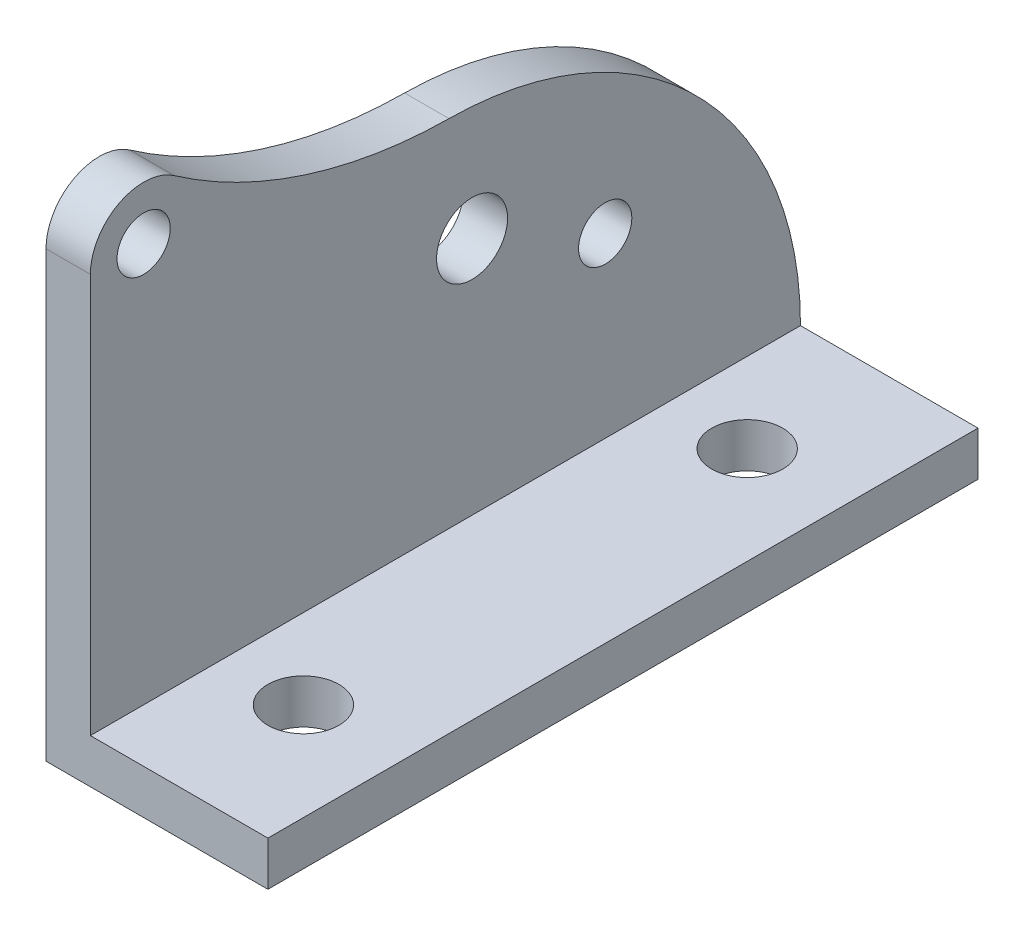
ISO-10303-21;
HEADER;
FILE_DESCRIPTION(('STEP AP214'),'2;1');
FILE_NAME('part.step','',(''),(''),'','','');
FILE_SCHEMA(('AUTOMOTIVE_DESIGN { 1 0 10303 214 1 1 1 1 }'));
ENDSEC;
DATA;
#1=APPLICATION_CONTEXT('core data for automotive mechanical design processes');
#2=APPLICATION_PROTOCOL_DEFINITION('international standard','automotive_design',2000,#1);
#3=PRODUCT_CONTEXT('',#1,'mechanical');
#4=PRODUCT('Part','Part','',(#3));
#5=PRODUCT_RELATED_PRODUCT_CATEGORY('part','',(#4));
#6=PRODUCT_DEFINITION_FORMATION('','',#4);
#7=PRODUCT_DEFINITION_CONTEXT('part definition',#1,'design');
#8=PRODUCT_DEFINITION('design','',#6,#7);
#9=PRODUCT_DEFINITION_SHAPE('','',#8);
#10=(LENGTH_UNIT() NAMED_UNIT(*) SI_UNIT(.MILLI.,.METRE.));
#11=(NAMED_UNIT(*) PLANE_ANGLE_UNIT() SI_UNIT($,.RADIAN.));
#12=(NAMED_UNIT(*) SI_UNIT($,.STERADIAN.) SOLID_ANGLE_UNIT());
#13=UNCERTAINTY_MEASURE_WITH_UNIT(LENGTH_MEASURE(1.E-05),#10,'distance_accuracy_value','');
#14=(GEOMETRIC_REPRESENTATION_CONTEXT(3) GLOBAL_UNCERTAINTY_ASSIGNED_CONTEXT((#13)) GLOBAL_UNIT_ASSIGNED_CONTEXT((#10,
#11,#12)) REPRESENTATION_CONTEXT('',''));
#15=CARTESIAN_POINT('',(0.,0.,0.));
#16=DIRECTION('',(0.,0.,1.));
#17=DIRECTION('',(1.,0.,0.));
#18=AXIS2_PLACEMENT_3D('',#15,#16,#17);
#19=CARTESIAN_POINT('',(5.,0.,0.));
#20=DIRECTION('',(1.,0.,0.));
#21=DIRECTION('',(0.,0.,-1.));
#22=AXIS2_PLACEMENT_3D('',#19,#20,#21);
#23=PLANE('',#22);
#24=CARTESIAN_POINT('',(5.,-25.,-18.));
#25=DIRECTION('',(1.,0.,0.));
#26=DIRECTION('',(0.,0.,-1.));
#27=AXIS2_PLACEMENT_3D('',#24,#25,#26);
#28=CIRCLE('',#27,3.);
#29=CARTESIAN_POINT('',(5.,-25.,-21.));
#30=VERTEX_POINT('',#29);
#31=EDGE_CURVE('E282',#30,#30,#28,.T.);
#32=ORIENTED_EDGE('',*,*,#31,.F.);
#33=EDGE_LOOP('',(#32));
#34=FACE_BOUND('',#33,.T.);
#35=CARTESIAN_POINT('',(5.,-18.,-2.99999999999999));
#36=DIRECTION('',(1.,0.,0.));
#37=DIRECTION('',(0.,0.,-1.));
#38=AXIS2_PLACEMENT_3D('',#35,#36,#37);
#39=CIRCLE('',#38,4.);
#40=CARTESIAN_POINT('',(5.,-18.,-6.99999999999999));
#41=VERTEX_POINT('',#40);
#42=EDGE_CURVE('E151',#41,#41,#39,.T.);
#43=ORIENTED_EDGE('',*,*,#42,.F.);
#44=EDGE_LOOP('',(#43));
#45=FACE_BOUND('',#44,.T.);
#46=CARTESIAN_POINT('',(5.,0.,34.));
#47=DIRECTION('',(1.,0.,0.));
#48=DIRECTION('',(0.,0.,-1.));
#49=AXIS2_PLACEMENT_3D('',#46,#47,#48);
#50=CIRCLE('',#49,5.99999999999999);
#51=CARTESIAN_POINT('',(5.,0.,40.));
#52=VERTEX_POINT('',#51);
#53=CARTESIAN_POINT('',(5.,4.91756595476615,30.5623343559146));
#54=VERTEX_POINT('',#53);
#55=EDGE_CURVE('E137',#52,#54,#50,.F.);
#56=ORIENTED_EDGE('',*,*,#55,.F.);
#57=DIRECTION('',(0.,-1.,0.));
#58=VECTOR('',#57,1.);
#59=CARTESIAN_POINT('',(5.,50.,40.));
#60=LINE('',#59,#58);
#61=CARTESIAN_POINT('',(5.,-45.,40.));
#62=VERTEX_POINT('',#61);
#63=EDGE_CURVE('E201',#52,#62,#60,.T.);
#64=ORIENTED_EDGE('',*,*,#63,.T.);
#65=DIRECTION('',(0.,0.,1.));
#66=VECTOR('',#65,1.);
#67=CARTESIAN_POINT('',(5.,-45.,40.));
#68=LINE('',#67,#66);
#69=CARTESIAN_POINT('',(5.,-45.,-40.));
#70=VERTEX_POINT('',#69);
#71=EDGE_CURVE('E169',#70,#62,#68,.T.);
#72=ORIENTED_EDGE('',*,*,#71,.F.);
#73=CARTESIAN_POINT('',(5.,-45.,0.));
#74=DIRECTION('',(1.,0.,0.));
#75=DIRECTION('',(0.,0.,-1.));
#76=AXIS2_PLACEMENT_3D('',#73,#74,#75);
#77=CIRCLE('',#76,40.);
#78=CARTESIAN_POINT('',(5.,-5.00199836907123,-0.399831879944413));
#79=VERTEX_POINT('',#78);
#80=EDGE_CURVE('E140',#79,#70,#77,.F.);
#81=ORIENTED_EDGE('',*,*,#80,.F.);
#82=CARTESIAN_POINT('',(5.,49.9952538734558,-0.949600714868));
#83=DIRECTION('',(1.,0.,0.));
#84=DIRECTION('',(0.,0.,-1.));
#85=AXIS2_PLACEMENT_3D('',#82,#83,#84);
#86=CIRCLE('',#85,55.);
#87=EDGE_CURVE('E123',#79,#54,#86,.F.);
#88=ORIENTED_EDGE('',*,*,#87,.T.);
#89=EDGE_LOOP('',(#56,#64,#72,#81,#88));
#90=FACE_BOUND('',#89,.T.);
#91=CARTESIAN_POINT('',(5.,0.,34.));
#92=DIRECTION('',(1.,0.,0.));
#93=DIRECTION('',(0.,0.,-1.));
#94=AXIS2_PLACEMENT_3D('',#91,#92,#93);
#95=CIRCLE('',#94,3.);
#96=CARTESIAN_POINT('',(5.,0.,31.));
#97=VERTEX_POINT('',#96);
#98=EDGE_CURVE('E143',#97,#97,#95,.F.);
#99=ORIENTED_EDGE('',*,*,#98,.T.);
#100=EDGE_LOOP('',(#99));
#101=FACE_BOUND('',#100,.T.);
#102=ADVANCED_FACE('F53',(#34,#45,#90,#101),#23,.T.);
#103=CARTESIAN_POINT('',(0.,0.,0.));
#104=DIRECTION('',(1.,0.,0.));
#105=DIRECTION('',(0.,0.,-1.));
#106=AXIS2_PLACEMENT_3D('',#103,#104,#105);
#107=PLANE('',#106);
#108=CARTESIAN_POINT('',(0.,-25.,-18.));
#109=DIRECTION('',(-1.,0.,0.));
#110=DIRECTION('',(0.,0.,1.));
#111=AXIS2_PLACEMENT_3D('',#108,#109,#110);
#112=CIRCLE('',#111,3.);
#113=CARTESIAN_POINT('',(0.,-25.,-15.));
#114=VERTEX_POINT('',#113);
#115=EDGE_CURVE('E285',#114,#114,#112,.T.);
#116=ORIENTED_EDGE('',*,*,#115,.F.);
#117=EDGE_LOOP('',(#116));
#118=FACE_BOUND('',#117,.T.);
#119=DIRECTION('',(0.,-1.,0.));
#120=VECTOR('',#119,1.);
#121=CARTESIAN_POINT('',(0.,50.,40.));
#122=LINE('',#121,#120);
#123=CARTESIAN_POINT('',(0.,0.,40.));
#124=VERTEX_POINT('',#123);
#125=CARTESIAN_POINT('',(0.,-50.,40.));
#126=VERTEX_POINT('',#125);
#127=EDGE_CURVE('E221',#124,#126,#122,.T.);
#128=ORIENTED_EDGE('',*,*,#127,.F.);
#129=CARTESIAN_POINT('',(0.,0.,34.));
#130=DIRECTION('',(1.,0.,0.));
#131=DIRECTION('',(0.,0.,-1.));
#132=AXIS2_PLACEMENT_3D('',#129,#130,#131);
#133=CIRCLE('',#132,5.99999999999999);
#134=CARTESIAN_POINT('',(0.,4.91756595476615,30.5623343559146));
#135=VERTEX_POINT('',#134);
#136=EDGE_CURVE('E125',#124,#135,#133,.F.);
#137=ORIENTED_EDGE('',*,*,#136,.T.);
#138=CARTESIAN_POINT('',(0.,49.9952538734558,-0.949600714868));
#139=DIRECTION('',(1.,0.,0.));
#140=DIRECTION('',(0.,0.,-1.));
#141=AXIS2_PLACEMENT_3D('',#138,#139,#140);
#142=CIRCLE('',#141,55.);
#143=CARTESIAN_POINT('',(0.,-5.00199836907123,-0.399831879944413));
#144=VERTEX_POINT('',#143);
#145=EDGE_CURVE('E120',#144,#135,#142,.F.);
#146=ORIENTED_EDGE('',*,*,#145,.F.);
#147=CARTESIAN_POINT('',(0.,-45.,0.));
#148=DIRECTION('',(1.,0.,0.));
#149=DIRECTION('',(0.,0.,-1.));
#150=AXIS2_PLACEMENT_3D('',#147,#148,#149);
#151=CIRCLE('',#150,40.);
#152=CARTESIAN_POINT('',(0.,-45.,-40.));
#153=VERTEX_POINT('',#152);
#154=EDGE_CURVE('E127',#144,#153,#151,.F.);
#155=ORIENTED_EDGE('',*,*,#154,.T.);
#156=DIRECTION('',(0.,1.,0.));
#157=VECTOR('',#156,1.);
#158=CARTESIAN_POINT('',(0.,50.,-40.));
#159=LINE('',#158,#157);
#160=CARTESIAN_POINT('',(0.,-50.,-40.));
#161=VERTEX_POINT('',#160);
#162=EDGE_CURVE('E198',#161,#153,#159,.T.);
#163=ORIENTED_EDGE('',*,*,#162,.F.);
#164=DIRECTION('',(0.,0.,-1.));
#165=VECTOR('',#164,1.);
#166=CARTESIAN_POINT('',(0.,-50.,40.));
#167=LINE('',#166,#165);
#168=EDGE_CURVE('E77',#126,#161,#167,.T.);
#169=ORIENTED_EDGE('',*,*,#168,.F.);
#170=EDGE_LOOP('',(#128,#137,#146,#155,#163,#169));
#171=FACE_BOUND('',#170,.T.);
#172=CARTESIAN_POINT('',(0.,-18.,-2.99999999999999));
#173=DIRECTION('',(1.,0.,0.));
#174=DIRECTION('',(0.,0.,-1.));
#175=AXIS2_PLACEMENT_3D('',#172,#173,#174);
#176=CIRCLE('',#175,4.);
#177=CARTESIAN_POINT('',(0.,-18.,-6.99999999999999));
#178=VERTEX_POINT('',#177);
#179=EDGE_CURVE('E154',#178,#178,#176,.T.);
#180=ORIENTED_EDGE('',*,*,#179,.T.);
#181=EDGE_LOOP('',(#180));
#182=FACE_BOUND('',#181,.T.);
#183=CARTESIAN_POINT('',(0.,0.,34.));
#184=DIRECTION('',(1.,0.,0.));
#185=DIRECTION('',(0.,0.,-1.));
#186=AXIS2_PLACEMENT_3D('',#183,#184,#185);
#187=CIRCLE('',#186,3.);
#188=CARTESIAN_POINT('',(0.,0.,31.));
#189=VERTEX_POINT('',#188);
#190=EDGE_CURVE('E147',#189,#189,#187,.F.);
#191=ORIENTED_EDGE('',*,*,#190,.F.);
#192=EDGE_LOOP('',(#191));
#193=FACE_BOUND('',#192,.T.);
#194=ADVANCED_FACE('F135',(#118,#171,#182,#193),#107,.F.);
#195=CARTESIAN_POINT('',(5.,50.,-40.));
#196=DIRECTION('',(0.,0.,1.));
#197=DIRECTION('',(0.,-1.,0.));
#198=AXIS2_PLACEMENT_3D('',#195,#196,#197);
#199=PLANE('',#198);
#200=DIRECTION('',(1.,0.,0.));
#201=VECTOR('',#200,1.);
#202=CARTESIAN_POINT('',(0.,-45.,-40.));
#203=LINE('',#202,#201);
#204=EDGE_CURVE('E70',#153,#70,#203,.T.);
#205=ORIENTED_EDGE('',*,*,#204,.T.);
#206=DIRECTION('',(-1.,0.,0.));
#207=VECTOR('',#206,1.);
#208=CARTESIAN_POINT('',(25.,-45.,-40.));
#209=LINE('',#208,#207);
#210=CARTESIAN_POINT('',(25.,-45.,-40.));
#211=VERTEX_POINT('',#210);
#212=EDGE_CURVE('E193',#211,#70,#209,.T.);
#213=ORIENTED_EDGE('',*,*,#212,.F.);
#214=DIRECTION('',(0.,1.,0.));
#215=VECTOR('',#214,1.);
#216=CARTESIAN_POINT('',(25.,-50.,-40.));
#217=LINE('',#216,#215);
#218=CARTESIAN_POINT('',(25.,-50.,-40.));
#219=VERTEX_POINT('',#218);
#220=EDGE_CURVE('E178',#219,#211,#217,.T.);
#221=ORIENTED_EDGE('',*,*,#220,.F.);
#222=DIRECTION('',(-1.,0.,0.));
#223=VECTOR('',#222,1.);
#224=CARTESIAN_POINT('',(5.,-50.,-40.));
#225=LINE('',#224,#223);
#226=EDGE_CURVE('E62',#219,#161,#225,.T.);
#227=ORIENTED_EDGE('',*,*,#226,.T.);
#228=ORIENTED_EDGE('',*,*,#162,.T.);
#229=EDGE_LOOP('',(#205,#213,#221,#227,#228));
#230=FACE_BOUND('',#229,.T.);
#231=ADVANCED_FACE('F55',(#230),#199,.F.);
#232=CARTESIAN_POINT('',(5.,50.,40.));
#233=DIRECTION('',(0.,0.,-1.));
#234=DIRECTION('',(0.,1.,0.));
#235=AXIS2_PLACEMENT_3D('',#232,#233,#234);
#236=PLANE('',#235);
#237=ORIENTED_EDGE('',*,*,#63,.F.);
#238=DIRECTION('',(1.,0.,0.));
#239=VECTOR('',#238,1.);
#240=CARTESIAN_POINT('',(0.,0.,40.));
#241=LINE('',#240,#239);
#242=EDGE_CURVE('E152',#124,#52,#241,.T.);
#243=ORIENTED_EDGE('',*,*,#242,.F.);
#244=ORIENTED_EDGE('',*,*,#127,.T.);
#245=DIRECTION('',(-1.,0.,0.));
#246=VECTOR('',#245,1.);
#247=CARTESIAN_POINT('',(5.,-50.,40.));
#248=LINE('',#247,#246);
#249=CARTESIAN_POINT('',(25.,-50.,40.));
#250=VERTEX_POINT('',#249);
#251=EDGE_CURVE('E12',#250,#126,#248,.T.);
#252=ORIENTED_EDGE('',*,*,#251,.F.);
#253=DIRECTION('',(0.,-1.,0.));
#254=VECTOR('',#253,1.);
#255=CARTESIAN_POINT('',(25.,-50.,40.));
#256=LINE('',#255,#254);
#257=CARTESIAN_POINT('',(25.,-45.,40.));
#258=VERTEX_POINT('',#257);
#259=EDGE_CURVE('E172',#258,#250,#256,.T.);
#260=ORIENTED_EDGE('',*,*,#259,.F.);
#261=DIRECTION('',(-1.,0.,0.));
#262=VECTOR('',#261,1.);
#263=CARTESIAN_POINT('',(25.,-45.,40.));
#264=LINE('',#263,#262);
#265=EDGE_CURVE('E182',#258,#62,#264,.T.);
#266=ORIENTED_EDGE('',*,*,#265,.T.);
#267=EDGE_LOOP('',(#237,#243,#244,#252,#260,#266));
#268=FACE_BOUND('',#267,.T.);
#269=ADVANCED_FACE('F226',(#268),#236,.F.);
#270=CARTESIAN_POINT('',(5.,-50.,40.));
#271=DIRECTION('',(0.,1.,0.));
#272=DIRECTION('',(0.,0.,1.));
#273=AXIS2_PLACEMENT_3D('',#270,#271,#272);
#274=PLANE('',#273);
#275=CARTESIAN_POINT('',(14.,-50.,25.));
#276=DIRECTION('',(0.,1.,0.));
#277=DIRECTION('',(0.,0.,1.));
#278=AXIS2_PLACEMENT_3D('',#275,#276,#277);
#279=CIRCLE('',#278,4.);
#280=CARTESIAN_POINT('',(14.,-50.,29.));
#281=VERTEX_POINT('',#280);
#282=EDGE_CURVE('E160',#281,#281,#279,.T.);
#283=ORIENTED_EDGE('',*,*,#282,.T.);
#284=EDGE_LOOP('',(#283));
#285=FACE_BOUND('',#284,.T.);
#286=CARTESIAN_POINT('',(14.,-50.,-25.));
#287=DIRECTION('',(0.,1.,0.));
#288=DIRECTION('',(0.,0.,1.));
#289=AXIS2_PLACEMENT_3D('',#286,#287,#288);
#290=CIRCLE('',#289,4.);
#291=CARTESIAN_POINT('',(14.,-50.,-21.));
#292=VERTEX_POINT('',#291);
#293=EDGE_CURVE('E166',#292,#292,#290,.T.);
#294=ORIENTED_EDGE('',*,*,#293,.T.);
#295=EDGE_LOOP('',(#294));
#296=FACE_BOUND('',#295,.T.);
#297=ORIENTED_EDGE('',*,*,#168,.T.);
#298=ORIENTED_EDGE('',*,*,#226,.F.);
#299=DIRECTION('',(0.,0.,-1.));
#300=VECTOR('',#299,1.);
#301=CARTESIAN_POINT('',(25.,-50.,40.));
#302=LINE('',#301,#300);
#303=EDGE_CURVE('E175',#250,#219,#302,.T.);
#304=ORIENTED_EDGE('',*,*,#303,.F.);
#305=ORIENTED_EDGE('',*,*,#251,.T.);
#306=EDGE_LOOP('',(#297,#298,#304,#305));
#307=FACE_BOUND('',#306,.T.);
#308=ADVANCED_FACE('F227',(#285,#296,#307),#274,.F.);
#309=CARTESIAN_POINT('',(25.,-45.,40.));
#310=DIRECTION('',(0.,-1.,0.));
#311=DIRECTION('',(0.,0.,-1.));
#312=AXIS2_PLACEMENT_3D('',#309,#310,#311);
#313=PLANE('',#312);
#314=CARTESIAN_POINT('',(14.,-45.,25.));
#315=DIRECTION('',(0.,1.,0.));
#316=DIRECTION('',(0.,0.,1.));
#317=AXIS2_PLACEMENT_3D('',#314,#315,#316);
#318=CIRCLE('',#317,4.);
#319=CARTESIAN_POINT('',(14.,-45.,29.));
#320=VERTEX_POINT('',#319);
#321=EDGE_CURVE('E157',#320,#320,#318,.T.);
#322=ORIENTED_EDGE('',*,*,#321,.F.);
#323=EDGE_LOOP('',(#322));
#324=FACE_BOUND('',#323,.T.);
#325=CARTESIAN_POINT('',(14.,-45.,-25.));
#326=DIRECTION('',(0.,1.,0.));
#327=DIRECTION('',(0.,0.,1.));
#328=AXIS2_PLACEMENT_3D('',#325,#326,#327);
#329=CIRCLE('',#328,4.);
#330=CARTESIAN_POINT('',(14.,-45.,-21.));
#331=VERTEX_POINT('',#330);
#332=EDGE_CURVE('E163',#331,#331,#329,.T.);
#333=ORIENTED_EDGE('',*,*,#332,.F.);
#334=EDGE_LOOP('',(#333));
#335=FACE_BOUND('',#334,.T.);
#336=ORIENTED_EDGE('',*,*,#71,.T.);
#337=ORIENTED_EDGE('',*,*,#265,.F.);
#338=DIRECTION('',(0.,0.,1.));
#339=VECTOR('',#338,1.);
#340=CARTESIAN_POINT('',(25.,-45.,40.));
#341=LINE('',#340,#339);
#342=EDGE_CURVE('E180',#211,#258,#341,.T.);
#343=ORIENTED_EDGE('',*,*,#342,.F.);
#344=ORIENTED_EDGE('',*,*,#212,.T.);
#345=EDGE_LOOP('',(#336,#337,#343,#344));
#346=FACE_BOUND('',#345,.T.);
#347=ADVANCED_FACE('F216',(#324,#335,#346),#313,.F.);
#348=CARTESIAN_POINT('',(25.,0.,0.));
#349=DIRECTION('',(-1.,0.,0.));
#350=DIRECTION('',(0.,0.,1.));
#351=AXIS2_PLACEMENT_3D('',#348,#349,#350);
#352=PLANE('',#351);
#353=ORIENTED_EDGE('',*,*,#259,.T.);
#354=ORIENTED_EDGE('',*,*,#303,.T.);
#355=ORIENTED_EDGE('',*,*,#220,.T.);
#356=ORIENTED_EDGE('',*,*,#342,.T.);
#357=EDGE_LOOP('',(#353,#354,#355,#356));
#358=FACE_BOUND('',#357,.T.);
#359=ADVANCED_FACE('F219',(#358),#352,.F.);
#360=CARTESIAN_POINT('',(14.,-50.,-25.));
#361=DIRECTION('',(0.,1.,0.));
#362=DIRECTION('',(0.,0.,1.));
#363=AXIS2_PLACEMENT_3D('',#360,#361,#362);
#364=CYLINDRICAL_SURFACE('',#363,4.);
#365=ORIENTED_EDGE('',*,*,#293,.F.);
#366=EDGE_LOOP('',(#365));
#367=FACE_BOUND('',#366,.T.);
#368=ORIENTED_EDGE('',*,*,#332,.T.);
#369=EDGE_LOOP('',(#368));
#370=FACE_BOUND('',#369,.T.);
#371=ADVANCED_FACE('F251',(#367,#370),#364,.F.);
#372=CARTESIAN_POINT('',(14.,-50.,25.));
#373=DIRECTION('',(0.,1.,0.));
#374=DIRECTION('',(0.,0.,1.));
#375=AXIS2_PLACEMENT_3D('',#372,#373,#374);
#376=CYLINDRICAL_SURFACE('',#375,4.);
#377=ORIENTED_EDGE('',*,*,#282,.F.);
#378=EDGE_LOOP('',(#377));
#379=FACE_BOUND('',#378,.T.);
#380=ORIENTED_EDGE('',*,*,#321,.T.);
#381=EDGE_LOOP('',(#380));
#382=FACE_BOUND('',#381,.T.);
#383=ADVANCED_FACE('F254',(#379,#382),#376,.F.);
#384=CARTESIAN_POINT('',(0.,-18.,-2.99999999999999));
#385=DIRECTION('',(1.,0.,0.));
#386=DIRECTION('',(0.,0.,-1.));
#387=AXIS2_PLACEMENT_3D('',#384,#385,#386);
#388=CYLINDRICAL_SURFACE('',#387,4.);
#389=ORIENTED_EDGE('',*,*,#179,.F.);
#390=EDGE_LOOP('',(#389));
#391=FACE_BOUND('',#390,.T.);
#392=ORIENTED_EDGE('',*,*,#42,.T.);
#393=EDGE_LOOP('',(#392));
#394=FACE_BOUND('',#393,.T.);
#395=ADVANCED_FACE('F258',(#391,#394),#388,.F.);
#396=CARTESIAN_POINT('',(0.,49.9952538734558,-0.949600714868));
#397=DIRECTION('',(1.,0.,0.));
#398=DIRECTION('',(0.,0.,-1.));
#399=AXIS2_PLACEMENT_3D('',#396,#397,#398);
#400=CYLINDRICAL_SURFACE('',#399,55.);
#401=ORIENTED_EDGE('',*,*,#87,.F.);
#402=DIRECTION('',(1.,0.,0.));
#403=VECTOR('',#402,1.);
#404=CARTESIAN_POINT('',(0.,-5.00199836907123,-0.399831879944413));
#405=LINE('',#404,#403);
#406=EDGE_CURVE('E117',#144,#79,#405,.T.);
#407=ORIENTED_EDGE('',*,*,#406,.F.);
#408=ORIENTED_EDGE('',*,*,#145,.T.);
#409=DIRECTION('',(1.,0.,0.));
#410=VECTOR('',#409,1.);
#411=CARTESIAN_POINT('',(0.,4.91756595476615,30.5623343559146));
#412=LINE('',#411,#410);
#413=EDGE_CURVE('E149',#135,#54,#412,.T.);
#414=ORIENTED_EDGE('',*,*,#413,.T.);
#415=EDGE_LOOP('',(#401,#407,#408,#414));
#416=FACE_BOUND('',#415,.T.);
#417=ADVANCED_FACE('F118',(#416),#400,.F.);
#418=CARTESIAN_POINT('',(0.,0.,34.));
#419=DIRECTION('',(1.,0.,0.));
#420=DIRECTION('',(0.,0.,-1.));
#421=AXIS2_PLACEMENT_3D('',#418,#419,#420);
#422=CYLINDRICAL_SURFACE('',#421,5.99999999999999);
#423=ORIENTED_EDGE('',*,*,#55,.T.);
#424=ORIENTED_EDGE('',*,*,#413,.F.);
#425=ORIENTED_EDGE('',*,*,#136,.F.);
#426=ORIENTED_EDGE('',*,*,#242,.T.);
#427=EDGE_LOOP('',(#423,#424,#425,#426));
#428=FACE_BOUND('',#427,.T.);
#429=ADVANCED_FACE('F265',(#428),#422,.T.);
#430=CARTESIAN_POINT('',(0.,-45.,0.));
#431=DIRECTION('',(1.,0.,0.));
#432=DIRECTION('',(0.,0.,-1.));
#433=AXIS2_PLACEMENT_3D('',#430,#431,#432);
#434=CYLINDRICAL_SURFACE('',#433,40.);
#435=ORIENTED_EDGE('',*,*,#80,.T.);
#436=ORIENTED_EDGE('',*,*,#204,.F.);
#437=ORIENTED_EDGE('',*,*,#154,.F.);
#438=ORIENTED_EDGE('',*,*,#406,.T.);
#439=EDGE_LOOP('',(#435,#436,#437,#438));
#440=FACE_BOUND('',#439,.T.);
#441=ADVANCED_FACE('F128',(#440),#434,.T.);
#442=CARTESIAN_POINT('',(0.,0.,34.));
#443=DIRECTION('',(1.,0.,0.));
#444=DIRECTION('',(0.,0.,-1.));
#445=AXIS2_PLACEMENT_3D('',#442,#443,#444);
#446=CYLINDRICAL_SURFACE('',#445,3.);
#447=ORIENTED_EDGE('',*,*,#190,.T.);
#448=EDGE_LOOP('',(#447));
#449=FACE_BOUND('',#448,.T.);
#450=ORIENTED_EDGE('',*,*,#98,.F.);
#451=EDGE_LOOP('',(#450));
#452=FACE_BOUND('',#451,.T.);
#453=ADVANCED_FACE('F268',(#449,#452),#446,.F.);
#454=CARTESIAN_POINT('',(10.,-25.,-18.));
#455=DIRECTION('',(-1.,0.,0.));
#456=DIRECTION('',(0.,0.,1.));
#457=AXIS2_PLACEMENT_3D('',#454,#455,#456);
#458=CYLINDRICAL_SURFACE('',#457,3.);
#459=ORIENTED_EDGE('',*,*,#31,.T.);
#460=EDGE_LOOP('',(#459));
#461=FACE_BOUND('',#460,.T.);
#462=ORIENTED_EDGE('',*,*,#115,.T.);
#463=EDGE_LOOP('',(#462));
#464=FACE_BOUND('',#463,.T.);
#465=ADVANCED_FACE('F274',(#461,#464),#458,.F.);
#466=CLOSED_SHELL('',(#102,#194,#231,#269,#308,#347,#359,#371,#383,#395,#417,#429,#441,#453,#465));
#467=MANIFOLD_SOLID_BREP('B2',#466);
#468=ADVANCED_BREP_SHAPE_REPRESENTATION('',(#18,#467),#14);
#469=SHAPE_DEFINITION_REPRESENTATION(#9,#468);
ENDSEC;
END-ISO-10303-21;
